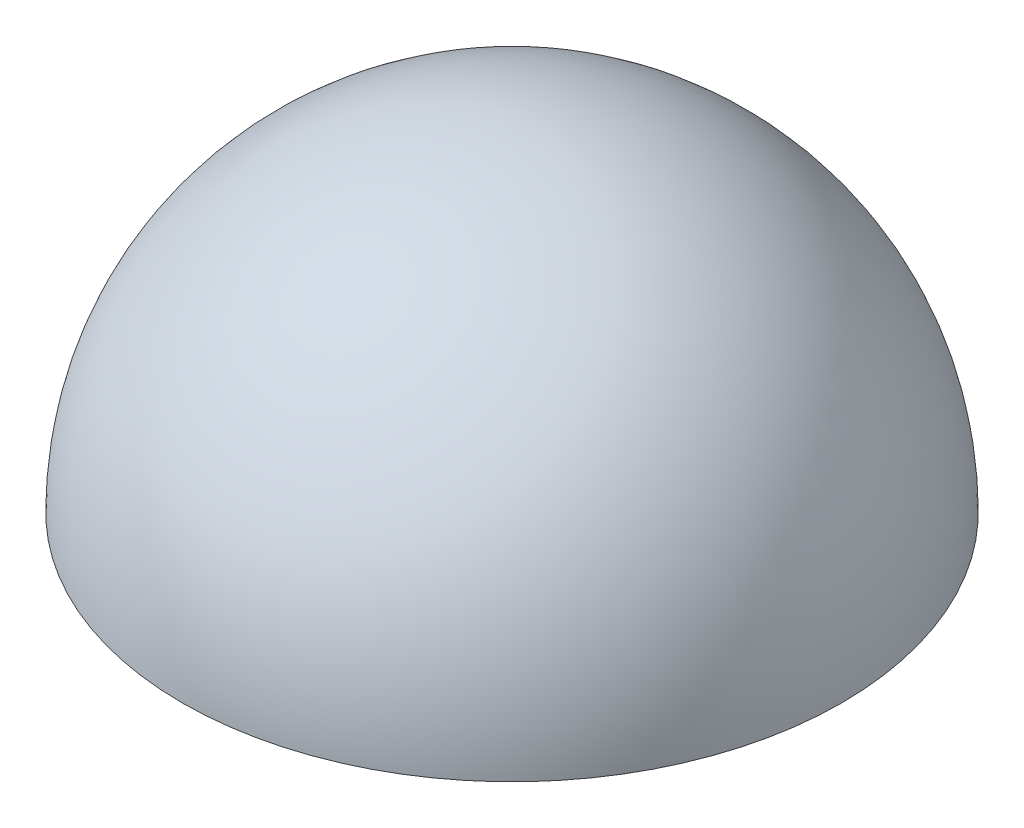
ISO-10303-21;
HEADER;
FILE_DESCRIPTION(('STEP AP214'),'2;1');
FILE_NAME('part.step','',(''),(''),'','','');
FILE_SCHEMA(('AUTOMOTIVE_DESIGN { 1 0 10303 214 1 1 1 1 }'));
ENDSEC;
DATA;
#1=APPLICATION_CONTEXT('core data for automotive mechanical design processes');
#2=APPLICATION_PROTOCOL_DEFINITION('international standard','automotive_design',2000,#1);
#3=PRODUCT_CONTEXT('',#1,'mechanical');
#4=PRODUCT('Part','Part','',(#3));
#5=PRODUCT_RELATED_PRODUCT_CATEGORY('part','',(#4));
#6=PRODUCT_DEFINITION_FORMATION('','',#4);
#7=PRODUCT_DEFINITION_CONTEXT('part definition',#1,'design');
#8=PRODUCT_DEFINITION('design','',#6,#7);
#9=PRODUCT_DEFINITION_SHAPE('','',#8);
#10=(LENGTH_UNIT() NAMED_UNIT(*) SI_UNIT(.MILLI.,.METRE.));
#11=(NAMED_UNIT(*) PLANE_ANGLE_UNIT() SI_UNIT($,.RADIAN.));
#12=(NAMED_UNIT(*) SI_UNIT($,.STERADIAN.) SOLID_ANGLE_UNIT());
#13=UNCERTAINTY_MEASURE_WITH_UNIT(LENGTH_MEASURE(1.E-05),#10,'distance_accuracy_value','');
#14=(GEOMETRIC_REPRESENTATION_CONTEXT(3) GLOBAL_UNCERTAINTY_ASSIGNED_CONTEXT((#13)) GLOBAL_UNIT_ASSIGNED_CONTEXT((#10,
#11,#12)) REPRESENTATION_CONTEXT('',''));
#15=CARTESIAN_POINT('',(0.,0.,0.));
#16=DIRECTION('',(0.,0.,1.));
#17=DIRECTION('',(1.,0.,0.));
#18=AXIS2_PLACEMENT_3D('',#15,#16,#17);
#19=CARTESIAN_POINT('',(0.,0.,0.));
#20=DIRECTION('',(0.,-1.,0.));
#21=DIRECTION('',(-1.,0.,0.));
#22=AXIS2_PLACEMENT_3D('',#19,#20,#21);
#23=SPHERICAL_SURFACE('',#22,11.);
#24=CARTESIAN_POINT('',(0.,0.,0.));
#25=DIRECTION('',(0.,-1.,0.));
#26=DIRECTION('',(0.,0.,-1.));
#27=AXIS2_PLACEMENT_3D('',#24,#25,#26);
#28=CIRCLE('',#27,11.);
#29=CARTESIAN_POINT('',(0.,0.,-11.));
#30=VERTEX_POINT('',#29);
#31=EDGE_CURVE('E10',#30,#30,#28,.T.);
#32=ORIENTED_EDGE('',*,*,#31,.T.);
#33=EDGE_LOOP('',(#32));
#34=FACE_BOUND('',#33,.T.);
#35=ADVANCED_FACE('F35',(#34),#23,.F.);
#36=CARTESIAN_POINT('',(-11.,0.,0.));
#37=DIRECTION('',(0.,1.,0.));
#38=DIRECTION('',(0.,0.,1.));
#39=AXIS2_PLACEMENT_3D('',#36,#37,#38);
#40=PLANE('',#39);
#41=ORIENTED_EDGE('',*,*,#31,.F.);
#42=EDGE_LOOP('',(#41));
#43=FACE_BOUND('',#42,.T.);
#44=CARTESIAN_POINT('',(0.,0.,0.));
#45=DIRECTION('',(0.,-1.,0.));
#46=DIRECTION('',(0.,0.,-1.));
#47=AXIS2_PLACEMENT_3D('',#44,#45,#46);
#48=CIRCLE('',#47,12.2);
#49=CARTESIAN_POINT('',(0.,0.,-12.2));
#50=VERTEX_POINT('',#49);
#51=EDGE_CURVE('E41',#50,#50,#48,.T.);
#52=ORIENTED_EDGE('',*,*,#51,.T.);
#53=EDGE_LOOP('',(#52));
#54=FACE_BOUND('',#53,.T.);
#55=ADVANCED_FACE('F47',(#43,#54),#40,.F.);
#56=CARTESIAN_POINT('',(0.,0.,0.));
#57=DIRECTION('',(0.,-1.,0.));
#58=DIRECTION('',(-1.,0.,0.));
#59=AXIS2_PLACEMENT_3D('',#56,#57,#58);
#60=SPHERICAL_SURFACE('',#59,12.2);
#61=ORIENTED_EDGE('',*,*,#51,.F.);
#62=EDGE_LOOP('',(#61));
#63=FACE_BOUND('',#62,.T.);
#64=ADVANCED_FACE('F49',(#63),#60,.T.);
#65=CLOSED_SHELL('',(#35,#55,#64));
#66=MANIFOLD_SOLID_BREP('B2',#65);
#67=ADVANCED_BREP_SHAPE_REPRESENTATION('',(#18,#66),#14);
#68=SHAPE_DEFINITION_REPRESENTATION(#9,#67);
ENDSEC;
END-ISO-10303-21;
